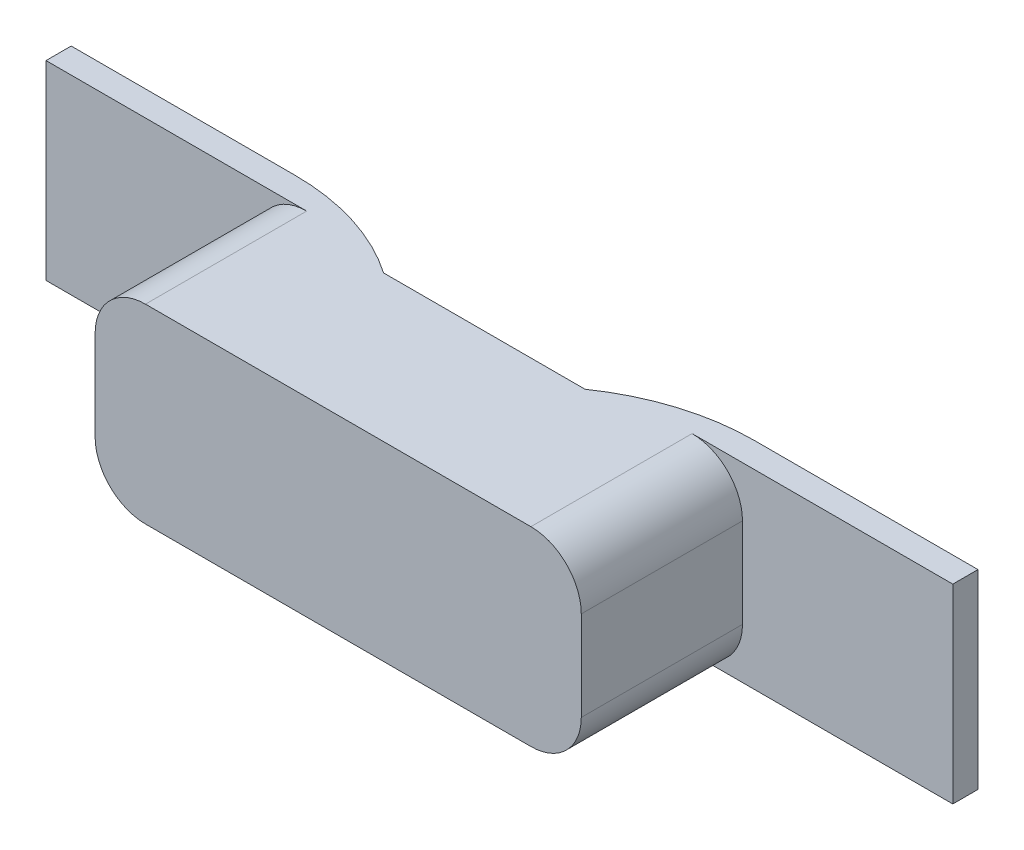
ISO-10303-21;
HEADER;
FILE_DESCRIPTION(('STEP AP214'),'2;1');
FILE_NAME('part.step','',(''),(''),'','','');
FILE_SCHEMA(('AUTOMOTIVE_DESIGN { 1 0 10303 214 1 1 1 1 }'));
ENDSEC;
DATA;
#1=APPLICATION_CONTEXT('core data for automotive mechanical design processes');
#2=APPLICATION_PROTOCOL_DEFINITION('international standard','automotive_design',2000,#1);
#3=PRODUCT_CONTEXT('',#1,'mechanical');
#4=PRODUCT('Part','Part','',(#3));
#5=PRODUCT_RELATED_PRODUCT_CATEGORY('part','',(#4));
#6=PRODUCT_DEFINITION_FORMATION('','',#4);
#7=PRODUCT_DEFINITION_CONTEXT('part definition',#1,'design');
#8=PRODUCT_DEFINITION('design','',#6,#7);
#9=PRODUCT_DEFINITION_SHAPE('','',#8);
#10=(LENGTH_UNIT() NAMED_UNIT(*) SI_UNIT(.MILLI.,.METRE.));
#11=(NAMED_UNIT(*) PLANE_ANGLE_UNIT() SI_UNIT($,.RADIAN.));
#12=(NAMED_UNIT(*) SI_UNIT($,.STERADIAN.) SOLID_ANGLE_UNIT());
#13=UNCERTAINTY_MEASURE_WITH_UNIT(LENGTH_MEASURE(1.E-05),#10,'distance_accuracy_value','');
#14=(GEOMETRIC_REPRESENTATION_CONTEXT(3) GLOBAL_UNCERTAINTY_ASSIGNED_CONTEXT((#13)) GLOBAL_UNIT_ASSIGNED_CONTEXT((#10,
#11,#12)) REPRESENTATION_CONTEXT('',''));
#15=CARTESIAN_POINT('',(0.,0.,0.));
#16=DIRECTION('',(0.,0.,1.));
#17=DIRECTION('',(1.,0.,0.));
#18=AXIS2_PLACEMENT_3D('',#15,#16,#17);
#19=CARTESIAN_POINT('',(0.,0.,0.));
#20=DIRECTION('',(0.,0.,-1.));
#21=DIRECTION('',(-1.,0.,0.));
#22=AXIS2_PLACEMENT_3D('',#19,#20,#21);
#23=PLANE('',#22);
#24=DIRECTION('',(-1.,0.,0.));
#25=VECTOR('',#24,1.);
#26=CARTESIAN_POINT('',(-9.,1.89,0.));
#27=LINE('',#26,#25);
#28=CARTESIAN_POINT('',(-4.56124969497314,1.89,0.));
#29=VERTEX_POINT('',#28);
#30=CARTESIAN_POINT('',(-9.,1.89,0.));
#31=VERTEX_POINT('',#30);
#32=EDGE_CURVE('E249',#29,#31,#27,.T.);
#33=ORIENTED_EDGE('',*,*,#32,.F.);
#34=DIRECTION('',(0.,-1.,0.));
#35=VECTOR('',#34,1.);
#36=CARTESIAN_POINT('',(-4.56124969497314,-1.89,0.));
#37=LINE('',#36,#35);
#38=CARTESIAN_POINT('',(-4.56124969497314,-1.89,0.));
#39=VERTEX_POINT('',#38);
#40=EDGE_CURVE('E58',#29,#39,#37,.T.);
#41=ORIENTED_EDGE('',*,*,#40,.T.);
#42=DIRECTION('',(1.,0.,0.));
#43=VECTOR('',#42,1.);
#44=CARTESIAN_POINT('',(-9.,-1.89,0.));
#45=LINE('',#44,#43);
#46=CARTESIAN_POINT('',(-9.,-1.89,0.));
#47=VERTEX_POINT('',#46);
#48=EDGE_CURVE('E238',#47,#39,#45,.T.);
#49=ORIENTED_EDGE('',*,*,#48,.F.);
#50=DIRECTION('',(0.,-1.,0.));
#51=VECTOR('',#50,1.);
#52=CARTESIAN_POINT('',(-9.,-1.89,0.));
#53=LINE('',#52,#51);
#54=EDGE_CURVE('E252',#31,#47,#53,.T.);
#55=ORIENTED_EDGE('',*,*,#54,.F.);
#56=EDGE_LOOP('',(#33,#41,#49,#55));
#57=FACE_BOUND('',#56,.T.);
#58=ADVANCED_FACE('F35',(#57),#23,.T.);
#59=CARTESIAN_POINT('',(0.,0.,0.5));
#60=DIRECTION('',(0.,0.,-1.));
#61=DIRECTION('',(-1.,0.,0.));
#62=AXIS2_PLACEMENT_3D('',#59,#60,#61);
#63=PLANE('',#62);
#64=CARTESIAN_POINT('',(-3.825,-0.890000000000001,0.5));
#65=DIRECTION('',(0.,0.,1.));
#66=DIRECTION('',(-1.,0.,0.));
#67=AXIS2_PLACEMENT_3D('',#64,#65,#66);
#68=CIRCLE('',#67,1.);
#69=CARTESIAN_POINT('',(-4.825,-0.890000000000001,0.5));
#70=VERTEX_POINT('',#69);
#71=CARTESIAN_POINT('',(-3.825,-1.89,0.5));
#72=VERTEX_POINT('',#71);
#73=EDGE_CURVE('E179',#70,#72,#68,.T.);
#74=ORIENTED_EDGE('',*,*,#73,.F.);
#75=DIRECTION('',(0.,-1.,0.));
#76=VECTOR('',#75,1.);
#77=CARTESIAN_POINT('',(-4.825,-0.890000000000001,0.5));
#78=LINE('',#77,#76);
#79=CARTESIAN_POINT('',(-4.825,0.890000000000001,0.5));
#80=VERTEX_POINT('',#79);
#81=EDGE_CURVE('E205',#80,#70,#78,.T.);
#82=ORIENTED_EDGE('',*,*,#81,.F.);
#83=CARTESIAN_POINT('',(-3.825,0.890000000000001,0.5));
#84=DIRECTION('',(0.,0.,1.));
#85=DIRECTION('',(-1.,0.,0.));
#86=AXIS2_PLACEMENT_3D('',#83,#84,#85);
#87=CIRCLE('',#86,1.);
#88=CARTESIAN_POINT('',(-3.825,1.89,0.5));
#89=VERTEX_POINT('',#88);
#90=EDGE_CURVE('E202',#89,#80,#87,.T.);
#91=ORIENTED_EDGE('',*,*,#90,.F.);
#92=DIRECTION('',(-1.,0.,0.));
#93=VECTOR('',#92,1.);
#94=CARTESIAN_POINT('',(-9.,1.89,0.5));
#95=LINE('',#94,#93);
#96=CARTESIAN_POINT('',(-9.,1.89,0.5));
#97=VERTEX_POINT('',#96);
#98=EDGE_CURVE('E237',#89,#97,#95,.T.);
#99=ORIENTED_EDGE('',*,*,#98,.T.);
#100=DIRECTION('',(0.,-1.,0.));
#101=VECTOR('',#100,1.);
#102=CARTESIAN_POINT('',(-9.,-1.89,0.5));
#103=LINE('',#102,#101);
#104=CARTESIAN_POINT('',(-9.,-1.89,0.5));
#105=VERTEX_POINT('',#104);
#106=EDGE_CURVE('E241',#97,#105,#103,.T.);
#107=ORIENTED_EDGE('',*,*,#106,.T.);
#108=DIRECTION('',(1.,0.,0.));
#109=VECTOR('',#108,1.);
#110=CARTESIAN_POINT('',(-9.,-1.89,0.5));
#111=LINE('',#110,#109);
#112=EDGE_CURVE('E244',#105,#72,#111,.T.);
#113=ORIENTED_EDGE('',*,*,#112,.T.);
#114=EDGE_LOOP('',(#74,#82,#91,#99,#107,#113));
#115=FACE_BOUND('',#114,.T.);
#116=ADVANCED_FACE('F325',(#115),#63,.F.);
#117=CARTESIAN_POINT('',(3.825,-0.890000000000001,0.5));
#118=DIRECTION('',(0.,0.,1.));
#119=DIRECTION('',(1.,0.,0.));
#120=AXIS2_PLACEMENT_3D('',#117,#118,#119);
#121=CIRCLE('',#120,1.);
#122=CARTESIAN_POINT('',(3.825,-1.89,0.5));
#123=VERTEX_POINT('',#122);
#124=CARTESIAN_POINT('',(4.825,-0.890000000000001,0.5));
#125=VERTEX_POINT('',#124);
#126=EDGE_CURVE('E174',#123,#125,#121,.T.);
#127=ORIENTED_EDGE('',*,*,#126,.F.);
#128=CARTESIAN_POINT('',(9.,-1.89,0.5));
#129=VERTEX_POINT('',#128);
#130=EDGE_CURVE('E243',#123,#129,#111,.T.);
#131=ORIENTED_EDGE('',*,*,#130,.T.);
#132=DIRECTION('',(0.,1.,0.));
#133=VECTOR('',#132,1.);
#134=CARTESIAN_POINT('',(9.,-1.89,0.5));
#135=LINE('',#134,#133);
#136=CARTESIAN_POINT('',(9.,1.89,0.5));
#137=VERTEX_POINT('',#136);
#138=EDGE_CURVE('E234',#129,#137,#135,.T.);
#139=ORIENTED_EDGE('',*,*,#138,.T.);
#140=CARTESIAN_POINT('',(3.825,1.89,0.5));
#141=VERTEX_POINT('',#140);
#142=EDGE_CURVE('E239',#137,#141,#95,.T.);
#143=ORIENTED_EDGE('',*,*,#142,.T.);
#144=CARTESIAN_POINT('',(3.825,0.890000000000001,0.5));
#145=DIRECTION('',(0.,0.,1.));
#146=DIRECTION('',(-1.,0.,0.));
#147=AXIS2_PLACEMENT_3D('',#144,#145,#146);
#148=CIRCLE('',#147,1.);
#149=CARTESIAN_POINT('',(4.825,0.890000000000001,0.5));
#150=VERTEX_POINT('',#149);
#151=EDGE_CURVE('E199',#150,#141,#148,.T.);
#152=ORIENTED_EDGE('',*,*,#151,.F.);
#153=DIRECTION('',(0.,1.,0.));
#154=VECTOR('',#153,1.);
#155=CARTESIAN_POINT('',(4.825,-0.890000000000001,0.5));
#156=LINE('',#155,#154);
#157=EDGE_CURVE('E196',#125,#150,#156,.T.);
#158=ORIENTED_EDGE('',*,*,#157,.F.);
#159=EDGE_LOOP('',(#127,#131,#139,#143,#152,#158));
#160=FACE_BOUND('',#159,.T.);
#161=ADVANCED_FACE('F295',(#160),#63,.F.);
#162=CARTESIAN_POINT('',(9.,-1.89,0.5));
#163=DIRECTION('',(-1.,0.,0.));
#164=DIRECTION('',(0.,0.,1.));
#165=AXIS2_PLACEMENT_3D('',#162,#163,#164);
#166=PLANE('',#165);
#167=DIRECTION('',(0.,1.,0.));
#168=VECTOR('',#167,1.);
#169=CARTESIAN_POINT('',(9.,-1.89,0.));
#170=LINE('',#169,#168);
#171=CARTESIAN_POINT('',(9.,-1.89,0.));
#172=VERTEX_POINT('',#171);
#173=CARTESIAN_POINT('',(9.,1.89,0.));
#174=VERTEX_POINT('',#173);
#175=EDGE_CURVE('E233',#172,#174,#170,.T.);
#176=ORIENTED_EDGE('',*,*,#175,.T.);
#177=DIRECTION('',(0.,0.,-1.));
#178=VECTOR('',#177,1.);
#179=CARTESIAN_POINT('',(9.,1.89,0.5));
#180=LINE('',#179,#178);
#181=EDGE_CURVE('E264',#137,#174,#180,.T.);
#182=ORIENTED_EDGE('',*,*,#181,.F.);
#183=ORIENTED_EDGE('',*,*,#138,.F.);
#184=DIRECTION('',(0.,0.,-1.));
#185=VECTOR('',#184,1.);
#186=CARTESIAN_POINT('',(9.,-1.89,0.5));
#187=LINE('',#186,#185);
#188=EDGE_CURVE('E246',#129,#172,#187,.T.);
#189=ORIENTED_EDGE('',*,*,#188,.T.);
#190=EDGE_LOOP('',(#176,#182,#183,#189));
#191=FACE_BOUND('',#190,.T.);
#192=ADVANCED_FACE('F310',(#191),#166,.F.);
#193=CARTESIAN_POINT('',(-9.,1.89,0.5));
#194=DIRECTION('',(0.,-1.,0.));
#195=DIRECTION('',(0.,0.,-1.));
#196=AXIS2_PLACEMENT_3D('',#193,#194,#195);
#197=PLANE('',#196);
#198=DIRECTION('',(1.,0.,0.));
#199=VECTOR('',#198,1.);
#200=CARTESIAN_POINT('',(2.,1.89,0.8));
#201=LINE('',#200,#199);
#202=CARTESIAN_POINT('',(-2.,1.89,0.8));
#203=VERTEX_POINT('',#202);
#204=CARTESIAN_POINT('',(2.,1.89,0.8));
#205=VERTEX_POINT('',#204);
#206=EDGE_CURVE('E162',#203,#205,#201,.T.);
#207=ORIENTED_EDGE('',*,*,#206,.F.);
#208=CARTESIAN_POINT('',(-4.56124969497314,1.89,4.5));
#209=DIRECTION('',(0.,-1.,0.));
#210=DIRECTION('',(0.,0.,-1.));
#211=AXIS2_PLACEMENT_3D('',#208,#209,#210);
#212=CIRCLE('',#211,4.5);
#213=EDGE_CURVE('E148',#203,#29,#212,.F.);
#214=ORIENTED_EDGE('',*,*,#213,.T.);
#215=ORIENTED_EDGE('',*,*,#32,.T.);
#216=DIRECTION('',(0.,0.,-1.));
#217=VECTOR('',#216,1.);
#218=CARTESIAN_POINT('',(-9.,1.89,0.5));
#219=LINE('',#218,#217);
#220=EDGE_CURVE('E261',#97,#31,#219,.T.);
#221=ORIENTED_EDGE('',*,*,#220,.F.);
#222=ORIENTED_EDGE('',*,*,#98,.F.);
#223=DIRECTION('',(0.,0.,-1.));
#224=VECTOR('',#223,1.);
#225=CARTESIAN_POINT('',(-3.825,1.89,3.7));
#226=LINE('',#225,#224);
#227=CARTESIAN_POINT('',(-3.825,1.89,3.7));
#228=VERTEX_POINT('',#227);
#229=EDGE_CURVE('E221',#228,#89,#226,.T.);
#230=ORIENTED_EDGE('',*,*,#229,.F.);
#231=DIRECTION('',(-1.,0.,0.));
#232=VECTOR('',#231,1.);
#233=CARTESIAN_POINT('',(-3.825,1.89,3.7));
#234=LINE('',#233,#232);
#235=CARTESIAN_POINT('',(3.825,1.89,3.7));
#236=VERTEX_POINT('',#235);
#237=EDGE_CURVE('E183',#236,#228,#234,.T.);
#238=ORIENTED_EDGE('',*,*,#237,.F.);
#239=DIRECTION('',(0.,0.,-1.));
#240=VECTOR('',#239,1.);
#241=CARTESIAN_POINT('',(3.825,1.89,3.7));
#242=LINE('',#241,#240);
#243=EDGE_CURVE('E224',#236,#141,#242,.T.);
#244=ORIENTED_EDGE('',*,*,#243,.T.);
#245=ORIENTED_EDGE('',*,*,#142,.F.);
#246=ORIENTED_EDGE('',*,*,#181,.T.);
#247=CARTESIAN_POINT('',(4.56124969497314,1.89,0.));
#248=VERTEX_POINT('',#247);
#249=EDGE_CURVE('E250',#174,#248,#27,.T.);
#250=ORIENTED_EDGE('',*,*,#249,.T.);
#251=CARTESIAN_POINT('',(4.56124969497314,1.89,4.5));
#252=DIRECTION('',(0.,-1.,0.));
#253=DIRECTION('',(0.,0.,-1.));
#254=AXIS2_PLACEMENT_3D('',#251,#252,#253);
#255=CIRCLE('',#254,4.5);
#256=EDGE_CURVE('E155',#248,#205,#255,.F.);
#257=ORIENTED_EDGE('',*,*,#256,.T.);
#258=EDGE_LOOP('',(#207,#214,#215,#221,#222,#230,#238,#244,#245,#246,#250,#257));
#259=FACE_BOUND('',#258,.T.);
#260=ADVANCED_FACE('F166',(#259),#197,.F.);
#261=CARTESIAN_POINT('',(-9.,-1.89,0.5));
#262=DIRECTION('',(1.,0.,0.));
#263=DIRECTION('',(0.,0.,-1.));
#264=AXIS2_PLACEMENT_3D('',#261,#262,#263);
#265=PLANE('',#264);
#266=ORIENTED_EDGE('',*,*,#54,.T.);
#267=DIRECTION('',(0.,0.,-1.));
#268=VECTOR('',#267,1.);
#269=CARTESIAN_POINT('',(-9.,-1.89,0.5));
#270=LINE('',#269,#268);
#271=EDGE_CURVE('E258',#105,#47,#270,.T.);
#272=ORIENTED_EDGE('',*,*,#271,.F.);
#273=ORIENTED_EDGE('',*,*,#106,.F.);
#274=ORIENTED_EDGE('',*,*,#220,.T.);
#275=EDGE_LOOP('',(#266,#272,#273,#274));
#276=FACE_BOUND('',#275,.T.);
#277=ADVANCED_FACE('F274',(#276),#265,.F.);
#278=CARTESIAN_POINT('',(-9.,-1.89,0.5));
#279=DIRECTION('',(0.,1.,0.));
#280=DIRECTION('',(0.,0.,1.));
#281=AXIS2_PLACEMENT_3D('',#278,#279,#280);
#282=PLANE('',#281);
#283=ORIENTED_EDGE('',*,*,#48,.T.);
#284=CARTESIAN_POINT('',(-4.56124969497314,-1.89,4.5));
#285=DIRECTION('',(0.,1.,0.));
#286=DIRECTION('',(0.,0.,1.));
#287=AXIS2_PLACEMENT_3D('',#284,#285,#286);
#288=CIRCLE('',#287,4.5);
#289=CARTESIAN_POINT('',(-2.,-1.89,0.8));
#290=VERTEX_POINT('',#289);
#291=EDGE_CURVE('E43',#39,#290,#288,.F.);
#292=ORIENTED_EDGE('',*,*,#291,.T.);
#293=DIRECTION('',(-1.,0.,0.));
#294=VECTOR('',#293,1.);
#295=CARTESIAN_POINT('',(2.,-1.89,0.8));
#296=LINE('',#295,#294);
#297=CARTESIAN_POINT('',(2.,-1.89,0.8));
#298=VERTEX_POINT('',#297);
#299=EDGE_CURVE('E164',#298,#290,#296,.T.);
#300=ORIENTED_EDGE('',*,*,#299,.F.);
#301=CARTESIAN_POINT('',(4.56124969497314,-1.89,4.5));
#302=DIRECTION('',(0.,1.,0.));
#303=DIRECTION('',(0.,0.,1.));
#304=AXIS2_PLACEMENT_3D('',#301,#302,#303);
#305=CIRCLE('',#304,4.5);
#306=CARTESIAN_POINT('',(4.56124969497314,-1.89,0.));
#307=VERTEX_POINT('',#306);
#308=EDGE_CURVE('E50',#298,#307,#305,.F.);
#309=ORIENTED_EDGE('',*,*,#308,.T.);
#310=EDGE_CURVE('E254',#307,#172,#45,.T.);
#311=ORIENTED_EDGE('',*,*,#310,.T.);
#312=ORIENTED_EDGE('',*,*,#188,.F.);
#313=ORIENTED_EDGE('',*,*,#130,.F.);
#314=DIRECTION('',(0.,0.,-1.));
#315=VECTOR('',#314,1.);
#316=CARTESIAN_POINT('',(3.825,-1.89,3.7));
#317=LINE('',#316,#315);
#318=CARTESIAN_POINT('',(3.825,-1.89,3.7));
#319=VERTEX_POINT('',#318);
#320=EDGE_CURVE('E193',#319,#123,#317,.T.);
#321=ORIENTED_EDGE('',*,*,#320,.F.);
#322=DIRECTION('',(1.,0.,0.));
#323=VECTOR('',#322,1.);
#324=CARTESIAN_POINT('',(-3.825,-1.89,3.7));
#325=LINE('',#324,#323);
#326=CARTESIAN_POINT('',(-3.825,-1.89,3.7));
#327=VERTEX_POINT('',#326);
#328=EDGE_CURVE('E191',#327,#319,#325,.T.);
#329=ORIENTED_EDGE('',*,*,#328,.F.);
#330=DIRECTION('',(0.,0.,-1.));
#331=VECTOR('',#330,1.);
#332=CARTESIAN_POINT('',(-3.825,-1.89,3.7));
#333=LINE('',#332,#331);
#334=EDGE_CURVE('E212',#327,#72,#333,.T.);
#335=ORIENTED_EDGE('',*,*,#334,.T.);
#336=ORIENTED_EDGE('',*,*,#112,.F.);
#337=ORIENTED_EDGE('',*,*,#271,.T.);
#338=EDGE_LOOP('',(#283,#292,#300,#309,#311,#312,#313,#321,#329,#335,#336,#337));
#339=FACE_BOUND('',#338,.T.);
#340=ADVANCED_FACE('F269',(#339),#282,.F.);
#341=ORIENTED_EDGE('',*,*,#310,.F.);
#342=DIRECTION('',(0.,1.,0.));
#343=VECTOR('',#342,1.);
#344=CARTESIAN_POINT('',(4.56124969497314,1.89,0.));
#345=LINE('',#344,#343);
#346=EDGE_CURVE('E11',#307,#248,#345,.T.);
#347=ORIENTED_EDGE('',*,*,#346,.T.);
#348=ORIENTED_EDGE('',*,*,#249,.F.);
#349=ORIENTED_EDGE('',*,*,#175,.F.);
#350=EDGE_LOOP('',(#341,#347,#348,#349));
#351=FACE_BOUND('',#350,.T.);
#352=ADVANCED_FACE('F314',(#351),#23,.T.);
#353=CARTESIAN_POINT('',(3.825,-0.890000000000001,3.7));
#354=DIRECTION('',(0.,0.,-1.));
#355=DIRECTION('',(-1.,0.,0.));
#356=AXIS2_PLACEMENT_3D('',#353,#354,#355);
#357=CYLINDRICAL_SURFACE('',#356,1.);
#358=ORIENTED_EDGE('',*,*,#126,.T.);
#359=DIRECTION('',(0.,0.,-1.));
#360=VECTOR('',#359,1.);
#361=CARTESIAN_POINT('',(4.825,-0.890000000000001,3.7));
#362=LINE('',#361,#360);
#363=CARTESIAN_POINT('',(4.825,-0.890000000000001,3.7));
#364=VERTEX_POINT('',#363);
#365=EDGE_CURVE('E230',#364,#125,#362,.T.);
#366=ORIENTED_EDGE('',*,*,#365,.F.);
#367=CARTESIAN_POINT('',(3.825,-0.890000000000001,3.7));
#368=DIRECTION('',(0.,0.,1.));
#369=DIRECTION('',(1.,0.,0.));
#370=AXIS2_PLACEMENT_3D('',#367,#368,#369);
#371=CIRCLE('',#370,1.);
#372=EDGE_CURVE('E175',#319,#364,#371,.T.);
#373=ORIENTED_EDGE('',*,*,#372,.F.);
#374=ORIENTED_EDGE('',*,*,#320,.T.);
#375=EDGE_LOOP('',(#358,#366,#373,#374));
#376=FACE_BOUND('',#375,.T.);
#377=ADVANCED_FACE('F301',(#376),#357,.T.);
#378=CARTESIAN_POINT('',(4.825,-0.890000000000001,3.7));
#379=DIRECTION('',(-1.,0.,0.));
#380=DIRECTION('',(0.,0.,1.));
#381=AXIS2_PLACEMENT_3D('',#378,#379,#380);
#382=PLANE('',#381);
#383=ORIENTED_EDGE('',*,*,#157,.T.);
#384=DIRECTION('',(0.,0.,-1.));
#385=VECTOR('',#384,1.);
#386=CARTESIAN_POINT('',(4.825,0.890000000000001,3.7));
#387=LINE('',#386,#385);
#388=CARTESIAN_POINT('',(4.825,0.890000000000001,3.7));
#389=VERTEX_POINT('',#388);
#390=EDGE_CURVE('E227',#389,#150,#387,.T.);
#391=ORIENTED_EDGE('',*,*,#390,.F.);
#392=DIRECTION('',(0.,1.,0.));
#393=VECTOR('',#392,1.);
#394=CARTESIAN_POINT('',(4.825,-0.890000000000001,3.7));
#395=LINE('',#394,#393);
#396=EDGE_CURVE('E178',#364,#389,#395,.T.);
#397=ORIENTED_EDGE('',*,*,#396,.F.);
#398=ORIENTED_EDGE('',*,*,#365,.T.);
#399=EDGE_LOOP('',(#383,#391,#397,#398));
#400=FACE_BOUND('',#399,.T.);
#401=ADVANCED_FACE('F297',(#400),#382,.F.);
#402=CARTESIAN_POINT('',(3.825,0.890000000000001,3.7));
#403=DIRECTION('',(0.,0.,-1.));
#404=DIRECTION('',(-1.,0.,0.));
#405=AXIS2_PLACEMENT_3D('',#402,#403,#404);
#406=CYLINDRICAL_SURFACE('',#405,1.);
#407=ORIENTED_EDGE('',*,*,#151,.T.);
#408=ORIENTED_EDGE('',*,*,#243,.F.);
#409=CARTESIAN_POINT('',(3.825,0.890000000000001,3.7));
#410=DIRECTION('',(0.,0.,1.));
#411=DIRECTION('',(-1.,0.,0.));
#412=AXIS2_PLACEMENT_3D('',#409,#410,#411);
#413=CIRCLE('',#412,1.);
#414=EDGE_CURVE('E181',#389,#236,#413,.T.);
#415=ORIENTED_EDGE('',*,*,#414,.F.);
#416=ORIENTED_EDGE('',*,*,#390,.T.);
#417=EDGE_LOOP('',(#407,#408,#415,#416));
#418=FACE_BOUND('',#417,.T.);
#419=ADVANCED_FACE('F292',(#418),#406,.T.);
#420=CARTESIAN_POINT('',(-3.825,0.890000000000001,3.7));
#421=DIRECTION('',(0.,0.,-1.));
#422=DIRECTION('',(-1.,0.,0.));
#423=AXIS2_PLACEMENT_3D('',#420,#421,#422);
#424=CYLINDRICAL_SURFACE('',#423,1.);
#425=ORIENTED_EDGE('',*,*,#90,.T.);
#426=DIRECTION('',(0.,0.,-1.));
#427=VECTOR('',#426,1.);
#428=CARTESIAN_POINT('',(-4.825,0.890000000000001,3.7));
#429=LINE('',#428,#427);
#430=CARTESIAN_POINT('',(-4.825,0.890000000000001,3.7));
#431=VERTEX_POINT('',#430);
#432=EDGE_CURVE('E218',#431,#80,#429,.T.);
#433=ORIENTED_EDGE('',*,*,#432,.F.);
#434=CARTESIAN_POINT('',(-3.825,0.890000000000001,3.7));
#435=DIRECTION('',(0.,0.,1.));
#436=DIRECTION('',(-1.,0.,0.));
#437=AXIS2_PLACEMENT_3D('',#434,#435,#436);
#438=CIRCLE('',#437,1.);
#439=EDGE_CURVE('E185',#228,#431,#438,.T.);
#440=ORIENTED_EDGE('',*,*,#439,.F.);
#441=ORIENTED_EDGE('',*,*,#229,.T.);
#442=EDGE_LOOP('',(#425,#433,#440,#441));
#443=FACE_BOUND('',#442,.T.);
#444=ADVANCED_FACE('F283',(#443),#424,.T.);
#445=CARTESIAN_POINT('',(-4.825,-0.890000000000001,3.7));
#446=DIRECTION('',(1.,0.,0.));
#447=DIRECTION('',(0.,0.,-1.));
#448=AXIS2_PLACEMENT_3D('',#445,#446,#447);
#449=PLANE('',#448);
#450=ORIENTED_EDGE('',*,*,#81,.T.);
#451=DIRECTION('',(0.,0.,-1.));
#452=VECTOR('',#451,1.);
#453=CARTESIAN_POINT('',(-4.825,-0.890000000000001,3.7));
#454=LINE('',#453,#452);
#455=CARTESIAN_POINT('',(-4.825,-0.890000000000001,3.7));
#456=VERTEX_POINT('',#455);
#457=EDGE_CURVE('E215',#456,#70,#454,.T.);
#458=ORIENTED_EDGE('',*,*,#457,.F.);
#459=DIRECTION('',(0.,-1.,0.));
#460=VECTOR('',#459,1.);
#461=CARTESIAN_POINT('',(-4.825,-0.890000000000001,3.7));
#462=LINE('',#461,#460);
#463=EDGE_CURVE('E187',#431,#456,#462,.T.);
#464=ORIENTED_EDGE('',*,*,#463,.F.);
#465=ORIENTED_EDGE('',*,*,#432,.T.);
#466=EDGE_LOOP('',(#450,#458,#464,#465));
#467=FACE_BOUND('',#466,.T.);
#468=ADVANCED_FACE('F339',(#467),#449,.F.);
#469=CARTESIAN_POINT('',(-3.825,-0.890000000000001,3.7));
#470=DIRECTION('',(0.,0.,-1.));
#471=DIRECTION('',(-1.,0.,0.));
#472=AXIS2_PLACEMENT_3D('',#469,#470,#471);
#473=CYLINDRICAL_SURFACE('',#472,1.);
#474=ORIENTED_EDGE('',*,*,#73,.T.);
#475=ORIENTED_EDGE('',*,*,#334,.F.);
#476=CARTESIAN_POINT('',(-3.825,-0.890000000000001,3.7));
#477=DIRECTION('',(0.,0.,1.));
#478=DIRECTION('',(-1.,0.,0.));
#479=AXIS2_PLACEMENT_3D('',#476,#477,#478);
#480=CIRCLE('',#479,1.);
#481=EDGE_CURVE('E189',#456,#327,#480,.T.);
#482=ORIENTED_EDGE('',*,*,#481,.F.);
#483=ORIENTED_EDGE('',*,*,#457,.T.);
#484=EDGE_LOOP('',(#474,#475,#482,#483));
#485=FACE_BOUND('',#484,.T.);
#486=ADVANCED_FACE('F342',(#485),#473,.T.);
#487=CARTESIAN_POINT('',(3.825,-0.890000000000001,3.7));
#488=DIRECTION('',(0.,0.,1.));
#489=DIRECTION('',(1.,0.,0.));
#490=AXIS2_PLACEMENT_3D('',#487,#488,#489);
#491=PLANE('',#490);
#492=ORIENTED_EDGE('',*,*,#372,.T.);
#493=ORIENTED_EDGE('',*,*,#396,.T.);
#494=ORIENTED_EDGE('',*,*,#414,.T.);
#495=ORIENTED_EDGE('',*,*,#237,.T.);
#496=ORIENTED_EDGE('',*,*,#439,.T.);
#497=ORIENTED_EDGE('',*,*,#463,.T.);
#498=ORIENTED_EDGE('',*,*,#481,.T.);
#499=ORIENTED_EDGE('',*,*,#328,.T.);
#500=EDGE_LOOP('',(#492,#493,#494,#495,#496,#497,#498,#499));
#501=FACE_BOUND('',#500,.T.);
#502=ADVANCED_FACE('F287',(#501),#491,.T.);
#503=CARTESIAN_POINT('',(0.,0.,0.8));
#504=DIRECTION('',(0.,0.,1.));
#505=DIRECTION('',(1.,0.,0.));
#506=AXIS2_PLACEMENT_3D('',#503,#504,#505);
#507=PLANE('',#506);
#508=DIRECTION('',(0.,1.,0.));
#509=VECTOR('',#508,1.);
#510=CARTESIAN_POINT('',(-2.,-1.89,0.8));
#511=LINE('',#510,#509);
#512=EDGE_CURVE('E152',#290,#203,#511,.T.);
#513=ORIENTED_EDGE('',*,*,#512,.T.);
#514=ORIENTED_EDGE('',*,*,#206,.T.);
#515=DIRECTION('',(0.,-1.,0.));
#516=VECTOR('',#515,1.);
#517=CARTESIAN_POINT('',(2.,-1.89,0.8));
#518=LINE('',#517,#516);
#519=EDGE_CURVE('E169',#205,#298,#518,.T.);
#520=ORIENTED_EDGE('',*,*,#519,.T.);
#521=ORIENTED_EDGE('',*,*,#299,.T.);
#522=EDGE_LOOP('',(#513,#514,#520,#521));
#523=FACE_BOUND('',#522,.T.);
#524=ADVANCED_FACE('F160',(#523),#507,.F.);
#525=CARTESIAN_POINT('',(-4.56124969497314,-1.89,4.5));
#526=DIRECTION('',(0.,1.,0.));
#527=DIRECTION('',(0.,0.,1.));
#528=AXIS2_PLACEMENT_3D('',#525,#526,#527);
#529=CYLINDRICAL_SURFACE('',#528,4.5);
#530=ORIENTED_EDGE('',*,*,#291,.F.);
#531=ORIENTED_EDGE('',*,*,#40,.F.);
#532=ORIENTED_EDGE('',*,*,#213,.F.);
#533=ORIENTED_EDGE('',*,*,#512,.F.);
#534=EDGE_LOOP('',(#530,#531,#532,#533));
#535=FACE_BOUND('',#534,.T.);
#536=ADVANCED_FACE('F151',(#535),#529,.T.);
#537=CARTESIAN_POINT('',(4.56124969497314,-1.89,4.5));
#538=DIRECTION('',(0.,-1.,0.));
#539=DIRECTION('',(0.,0.,-1.));
#540=AXIS2_PLACEMENT_3D('',#537,#538,#539);
#541=CYLINDRICAL_SURFACE('',#540,4.5);
#542=ORIENTED_EDGE('',*,*,#256,.F.);
#543=ORIENTED_EDGE('',*,*,#346,.F.);
#544=ORIENTED_EDGE('',*,*,#308,.F.);
#545=ORIENTED_EDGE('',*,*,#519,.F.);
#546=EDGE_LOOP('',(#542,#543,#544,#545));
#547=FACE_BOUND('',#546,.T.);
#548=ADVANCED_FACE('F37',(#547),#541,.T.);
#549=CLOSED_SHELL('',(#58,#116,#161,#192,#260,#277,#340,#352,#377,#401,#419,#444,#468,#486,#502,
#524,#536,#548));
#550=MANIFOLD_SOLID_BREP('B2',#549);
#551=ADVANCED_BREP_SHAPE_REPRESENTATION('',(#18,#550),#14);
#552=SHAPE_DEFINITION_REPRESENTATION(#9,#551);
ENDSEC;
END-ISO-10303-21;
